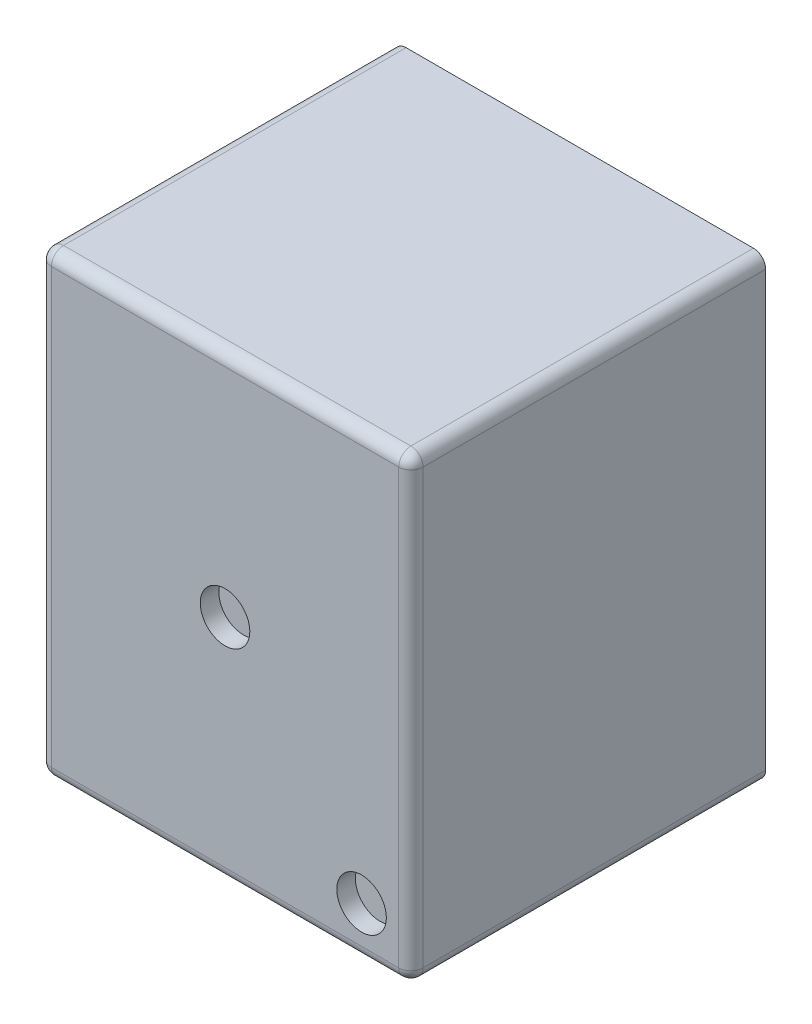
ISO-10303-21;
HEADER;
FILE_DESCRIPTION(('STEP AP214'),'2;1');
FILE_NAME('part.step','',(''),(''),'','','');
FILE_SCHEMA(('AUTOMOTIVE_DESIGN { 1 0 10303 214 1 1 1 1 }'));
ENDSEC;
DATA;
#1=APPLICATION_CONTEXT('core data for automotive mechanical design processes');
#2=APPLICATION_PROTOCOL_DEFINITION('international standard','automotive_design',2000,#1);
#3=PRODUCT_CONTEXT('',#1,'mechanical');
#4=PRODUCT('Part','Part','',(#3));
#5=PRODUCT_RELATED_PRODUCT_CATEGORY('part','',(#4));
#6=PRODUCT_DEFINITION_FORMATION('','',#4);
#7=PRODUCT_DEFINITION_CONTEXT('part definition',#1,'design');
#8=PRODUCT_DEFINITION('design','',#6,#7);
#9=PRODUCT_DEFINITION_SHAPE('','',#8);
#10=(LENGTH_UNIT() NAMED_UNIT(*) SI_UNIT(.MILLI.,.METRE.));
#11=(NAMED_UNIT(*) PLANE_ANGLE_UNIT() SI_UNIT($,.RADIAN.));
#12=(NAMED_UNIT(*) SI_UNIT($,.STERADIAN.) SOLID_ANGLE_UNIT());
#13=UNCERTAINTY_MEASURE_WITH_UNIT(LENGTH_MEASURE(1.E-05),#10,'distance_accuracy_value','');
#14=(GEOMETRIC_REPRESENTATION_CONTEXT(3) GLOBAL_UNCERTAINTY_ASSIGNED_CONTEXT((#13)) GLOBAL_UNIT_ASSIGNED_CONTEXT((#10,
#11,#12)) REPRESENTATION_CONTEXT('',''));
#15=CARTESIAN_POINT('',(0.,0.,0.));
#16=DIRECTION('',(0.,0.,1.));
#17=DIRECTION('',(1.,0.,0.));
#18=AXIS2_PLACEMENT_3D('',#15,#16,#17);
#19=CARTESIAN_POINT('',(0.352635714690617,0.168780356945077,0.617807641667743));
#20=DIRECTION('',(0.,0.,1.));
#21=DIRECTION('',(1.,0.,0.));
#22=AXIS2_PLACEMENT_3D('',#19,#20,#21);
#23=PLANE('',#22);
#24=CARTESIAN_POINT('',(0.352635714690617,0.168780356945077,0.617807641667743));
#25=DIRECTION('',(0.,0.,1.));
#26=DIRECTION('',(1.,0.,0.));
#27=AXIS2_PLACEMENT_3D('',#24,#25,#26);
#28=CIRCLE('',#27,0.04);
#29=CARTESIAN_POINT('',(0.392635714690617,0.168780356945077,0.617807641667743));
#30=VERTEX_POINT('',#29);
#31=EDGE_CURVE('E20',#30,#30,#28,.T.);
#32=ORIENTED_EDGE('',*,*,#31,.T.);
#33=EDGE_LOOP('',(#32));
#34=FACE_BOUND('',#33,.T.);
#35=ADVANCED_FACE('F17',(#34),#23,.T.);
#36=CARTESIAN_POINT('',(0.573079757545916,-0.121368087614107,0.617807641667743));
#37=DIRECTION('',(0.,0.,1.));
#38=DIRECTION('',(1.,0.,0.));
#39=AXIS2_PLACEMENT_3D('',#36,#37,#38);
#40=PLANE('',#39);
#41=CARTESIAN_POINT('',(0.573079757545916,-0.121368087614107,0.617807641667743));
#42=DIRECTION('',(0.,0.,1.));
#43=DIRECTION('',(1.,0.,0.));
#44=AXIS2_PLACEMENT_3D('',#41,#42,#43);
#45=CIRCLE('',#44,0.04);
#46=CARTESIAN_POINT('',(0.613079757545916,-0.121368087614107,0.617807641667743));
#47=VERTEX_POINT('',#46);
#48=EDGE_CURVE('E175',#47,#47,#45,.T.);
#49=ORIENTED_EDGE('',*,*,#48,.T.);
#50=EDGE_LOOP('',(#49));
#51=FACE_BOUND('',#50,.T.);
#52=ADVANCED_FACE('F187',(#51),#40,.T.);
#53=CARTESIAN_POINT('',(0.352635714690617,0.168780356945077,0.647807641667743));
#54=DIRECTION('',(0.,0.,1.));
#55=DIRECTION('',(1.,0.,0.));
#56=AXIS2_PLACEMENT_3D('',#53,#54,#55);
#57=CYLINDRICAL_SURFACE('',#56,0.04);
#58=ORIENTED_EDGE('',*,*,#31,.F.);
#59=EDGE_LOOP('',(#58));
#60=FACE_BOUND('',#59,.T.);
#61=CARTESIAN_POINT('',(0.352635714690617,0.168780356945077,0.647807641667743));
#62=DIRECTION('',(0.,0.,1.));
#63=DIRECTION('',(1.,0.,0.));
#64=AXIS2_PLACEMENT_3D('',#61,#62,#63);
#65=CIRCLE('',#64,0.04);
#66=CARTESIAN_POINT('',(0.392635714690617,0.168780356945077,0.647807641667743));
#67=VERTEX_POINT('',#66);
#68=EDGE_CURVE('E173',#67,#67,#65,.T.);
#69=ORIENTED_EDGE('',*,*,#68,.T.);
#70=EDGE_LOOP('',(#69));
#71=FACE_BOUND('',#70,.T.);
#72=ADVANCED_FACE('F183',(#60,#71),#57,.F.);
#73=CARTESIAN_POINT('',(0.573079757545916,-0.121368087614107,0.647807641667743));
#74=DIRECTION('',(0.,0.,1.));
#75=DIRECTION('',(1.,0.,0.));
#76=AXIS2_PLACEMENT_3D('',#73,#74,#75);
#77=CYLINDRICAL_SURFACE('',#76,0.04);
#78=ORIENTED_EDGE('',*,*,#48,.F.);
#79=EDGE_LOOP('',(#78));
#80=FACE_BOUND('',#79,.T.);
#81=CARTESIAN_POINT('',(0.573079757545916,-0.121368087614107,0.647807641667743));
#82=DIRECTION('',(0.,0.,1.));
#83=DIRECTION('',(1.,0.,0.));
#84=AXIS2_PLACEMENT_3D('',#81,#82,#83);
#85=CIRCLE('',#84,0.04);
#86=CARTESIAN_POINT('',(0.613079757545916,-0.121368087614107,0.647807641667743));
#87=VERTEX_POINT('',#86);
#88=EDGE_CURVE('E139',#87,#87,#85,.T.);
#89=ORIENTED_EDGE('',*,*,#88,.T.);
#90=EDGE_LOOP('',(#89));
#91=FACE_BOUND('',#90,.T.);
#92=ADVANCED_FACE('F186',(#80,#91),#77,.F.);
#93=CARTESIAN_POINT('',(0.0441472675497887,0.55394364596018,0.647807641667743));
#94=DIRECTION('',(0.,0.,-1.));
#95=DIRECTION('',(-1.,0.,0.));
#96=AXIS2_PLACEMENT_3D('',#93,#94,#95);
#97=PLANE('',#96);
#98=DIRECTION('',(0.,-1.,0.));
#99=VECTOR('',#98,1.);
#100=CARTESIAN_POINT('',(0.633079757545916,-0.216382932070025,0.647807641667743));
#101=LINE('',#100,#99);
#102=CARTESIAN_POINT('',(0.633079757545916,0.518928801504261,0.647807641667743));
#103=VERTEX_POINT('',#102);
#104=CARTESIAN_POINT('',(0.633079757545916,-0.181368087614107,0.647807641667743));
#105=VERTEX_POINT('',#104);
#106=EDGE_CURVE('E132',#103,#105,#101,.T.);
#107=ORIENTED_EDGE('',*,*,#106,.F.);
#108=DIRECTION('',(1.,0.,0.));
#109=VECTOR('',#108,1.);
#110=CARTESIAN_POINT('',(0.661124161831446,0.518928801504262,0.647807641667743));
#111=LINE('',#110,#109);
#112=CARTESIAN_POINT('',(0.0721916718353179,0.518928801504262,0.647807641667743));
#113=VERTEX_POINT('',#112);
#114=EDGE_CURVE('E126',#113,#103,#111,.T.);
#115=ORIENTED_EDGE('',*,*,#114,.F.);
#116=DIRECTION('',(0.,1.,0.));
#117=VECTOR('',#116,1.);
#118=CARTESIAN_POINT('',(0.0721916718353185,0.55394364596018,0.647807641667743));
#119=LINE('',#118,#117);
#120=CARTESIAN_POINT('',(0.0721916718353179,-0.181368087614107,0.647807641667743));
#121=VERTEX_POINT('',#120);
#122=EDGE_CURVE('E155',#121,#113,#119,.T.);
#123=ORIENTED_EDGE('',*,*,#122,.F.);
#124=DIRECTION('',(-1.,0.,0.));
#125=VECTOR('',#124,1.);
#126=CARTESIAN_POINT('',(0.0441472675497874,-0.181368087614107,0.647807641667743));
#127=LINE('',#126,#125);
#128=EDGE_CURVE('E131',#105,#121,#127,.T.);
#129=ORIENTED_EDGE('',*,*,#128,.F.);
#130=EDGE_LOOP('',(#107,#115,#123,#129));
#131=FACE_BOUND('',#130,.T.);
#132=ORIENTED_EDGE('',*,*,#88,.F.);
#133=EDGE_LOOP('',(#132));
#134=FACE_BOUND('',#133,.T.);
#135=ORIENTED_EDGE('',*,*,#68,.F.);
#136=EDGE_LOOP('',(#135));
#137=FACE_BOUND('',#136,.T.);
#138=ADVANCED_FACE('F135',(#131,#134,#137),#97,.F.);
#139=CARTESIAN_POINT('',(0.0441472675497874,-0.181368087614107,0.628135510520202));
#140=DIRECTION('',(-1.,0.,0.));
#141=DIRECTION('',(0.,-1.,0.));
#142=AXIS2_PLACEMENT_3D('',#139,#140,#141);
#143=CYLINDRICAL_SURFACE('',#142,0.019672131147541);
#144=DIRECTION('',(1.,0.,0.));
#145=VECTOR('',#144,1.);
#146=CARTESIAN_POINT('',(0.0525195406877774,-0.201040218761648,0.628135510520202));
#147=LINE('',#146,#145);
#148=CARTESIAN_POINT('',(0.633079757545916,-0.201040218761648,0.628135510520202));
#149=VERTEX_POINT('',#148);
#150=CARTESIAN_POINT('',(0.0721916718353173,-0.201040218761648,0.628135510520202));
#151=VERTEX_POINT('',#150);
#152=EDGE_CURVE('E293',#149,#151,#147,.F.);
#153=ORIENTED_EDGE('',*,*,#152,.F.);
#154=CARTESIAN_POINT('',(0.633079757545916,-0.181368087614107,0.628135510520202));
#155=DIRECTION('',(-1.,0.,0.));
#156=DIRECTION('',(0.,-1.,0.));
#157=AXIS2_PLACEMENT_3D('',#154,#155,#156);
#158=CIRCLE('',#157,0.019672131147541);
#159=EDGE_CURVE('E147',#105,#149,#158,.F.);
#160=ORIENTED_EDGE('',*,*,#159,.F.);
#161=ORIENTED_EDGE('',*,*,#128,.T.);
#162=CARTESIAN_POINT('',(0.0721916718353173,-0.181368087614107,0.628135510520202));
#163=DIRECTION('',(-1.,0.,0.));
#164=DIRECTION('',(0.,-1.,0.));
#165=AXIS2_PLACEMENT_3D('',#162,#163,#164);
#166=CIRCLE('',#165,0.019672131147541);
#167=EDGE_CURVE('E260',#151,#121,#166,.T.);
#168=ORIENTED_EDGE('',*,*,#167,.F.);
#169=EDGE_LOOP('',(#153,#160,#161,#168));
#170=FACE_BOUND('',#169,.T.);
#171=ADVANCED_FACE('F192',(#170),#143,.T.);
#172=CARTESIAN_POINT('',(0.633079757545916,-0.181368087614107,0.628135510520202));
#173=DIRECTION('',(0.,-1.,0.));
#174=DIRECTION('',(0.,0.,1.));
#175=AXIS2_PLACEMENT_3D('',#172,#173,#174);
#176=SPHERICAL_SURFACE('',#175,0.019672131147541);
#177=CARTESIAN_POINT('',(0.633079757545916,-0.181368087614107,0.628135510520202));
#178=DIRECTION('',(0.,-1.,0.));
#179=DIRECTION('',(1.,0.,0.));
#180=AXIS2_PLACEMENT_3D('',#177,#178,#179);
#181=CIRCLE('',#180,0.019672131147541);
#182=CARTESIAN_POINT('',(0.652751888693457,-0.181368087614107,0.628135510520202));
#183=VERTEX_POINT('',#182);
#184=EDGE_CURVE('E106',#105,#183,#181,.F.);
#185=ORIENTED_EDGE('',*,*,#184,.F.);
#186=ORIENTED_EDGE('',*,*,#159,.T.);
#187=CARTESIAN_POINT('',(0.633079757545916,-0.181368087614107,0.628135510520202));
#188=DIRECTION('',(0.,0.,-1.));
#189=DIRECTION('',(-1.,0.,0.));
#190=AXIS2_PLACEMENT_3D('',#187,#188,#189);
#191=CIRCLE('',#190,0.019672131147541);
#192=EDGE_CURVE('E283',#183,#149,#191,.T.);
#193=ORIENTED_EDGE('',*,*,#192,.F.);
#194=EDGE_LOOP('',(#185,#186,#193));
#195=FACE_BOUND('',#194,.T.);
#196=ADVANCED_FACE('F199',(#195),#176,.T.);
#197=CARTESIAN_POINT('',(0.633079757545916,-0.216382932070025,0.628135510520202));
#198=DIRECTION('',(0.,-1.,0.));
#199=DIRECTION('',(1.,0.,0.));
#200=AXIS2_PLACEMENT_3D('',#197,#198,#199);
#201=CYLINDRICAL_SURFACE('',#200,0.019672131147541);
#202=DIRECTION('',(0.,1.,0.));
#203=VECTOR('',#202,1.);
#204=CARTESIAN_POINT('',(0.652751888693456,-0.201040218761648,0.628135510520202));
#205=LINE('',#204,#203);
#206=CARTESIAN_POINT('',(0.652751888693457,0.518928801504261,0.628135510520202));
#207=VERTEX_POINT('',#206);
#208=EDGE_CURVE('E144',#207,#183,#205,.F.);
#209=ORIENTED_EDGE('',*,*,#208,.F.);
#210=CARTESIAN_POINT('',(0.633079757545916,0.518928801504261,0.628135510520202));
#211=DIRECTION('',(0.,-1.,0.));
#212=DIRECTION('',(0.,0.,1.));
#213=AXIS2_PLACEMENT_3D('',#210,#211,#212);
#214=CIRCLE('',#213,0.0196721311475411);
#215=EDGE_CURVE('E115',#103,#207,#214,.F.);
#216=ORIENTED_EDGE('',*,*,#215,.F.);
#217=ORIENTED_EDGE('',*,*,#106,.T.);
#218=ORIENTED_EDGE('',*,*,#184,.T.);
#219=EDGE_LOOP('',(#209,#216,#217,#218));
#220=FACE_BOUND('',#219,.T.);
#221=ADVANCED_FACE('F142',(#220),#201,.T.);
#222=CARTESIAN_POINT('',(0.633079757545916,0.518928801504261,0.628135510520202));
#223=DIRECTION('',(0.,-1.,0.));
#224=DIRECTION('',(0.,0.,1.));
#225=AXIS2_PLACEMENT_3D('',#222,#223,#224);
#226=SPHERICAL_SURFACE('',#225,0.019672131147541);
#227=CARTESIAN_POINT('',(0.633079757545916,0.518928801504261,0.628135510520202));
#228=DIRECTION('',(1.,0.,0.));
#229=DIRECTION('',(0.,1.,0.));
#230=AXIS2_PLACEMENT_3D('',#227,#228,#229);
#231=CIRCLE('',#230,0.019672131147541);
#232=CARTESIAN_POINT('',(0.633079757545916,0.538600932651802,0.628135510520202));
#233=VERTEX_POINT('',#232);
#234=EDGE_CURVE('E111',#103,#233,#231,.F.);
#235=ORIENTED_EDGE('',*,*,#234,.F.);
#236=ORIENTED_EDGE('',*,*,#215,.T.);
#237=CARTESIAN_POINT('',(0.633079757545916,0.518928801504261,0.628135510520202));
#238=DIRECTION('',(0.,0.,-1.));
#239=DIRECTION('',(-1.,0.,0.));
#240=AXIS2_PLACEMENT_3D('',#237,#238,#239);
#241=CIRCLE('',#240,0.019672131147541);
#242=EDGE_CURVE('E117',#233,#207,#241,.T.);
#243=ORIENTED_EDGE('',*,*,#242,.F.);
#244=EDGE_LOOP('',(#235,#236,#243));
#245=FACE_BOUND('',#244,.T.);
#246=ADVANCED_FACE('F113',(#245),#226,.T.);
#247=CARTESIAN_POINT('',(0.661124161831446,0.518928801504261,0.628135510520202));
#248=DIRECTION('',(1.,0.,0.));
#249=DIRECTION('',(0.,1.,0.));
#250=AXIS2_PLACEMENT_3D('',#247,#248,#249);
#251=CYLINDRICAL_SURFACE('',#250,0.019672131147541);
#252=DIRECTION('',(-1.,0.,0.));
#253=VECTOR('',#252,1.);
#254=CARTESIAN_POINT('',(0.652751888693456,0.538600932651802,0.628135510520202));
#255=LINE('',#254,#253);
#256=CARTESIAN_POINT('',(0.0721916718353177,0.538600932651803,0.628135510520202));
#257=VERTEX_POINT('',#256);
#258=EDGE_CURVE('E265',#257,#233,#255,.F.);
#259=ORIENTED_EDGE('',*,*,#258,.F.);
#260=CARTESIAN_POINT('',(0.0721916718353177,0.518928801504262,0.628135510520202));
#261=DIRECTION('',(-1.,0.,0.));
#262=DIRECTION('',(0.,-1.,0.));
#263=AXIS2_PLACEMENT_3D('',#260,#261,#262);
#264=CIRCLE('',#263,0.019672131147541);
#265=EDGE_CURVE('E122',#113,#257,#264,.T.);
#266=ORIENTED_EDGE('',*,*,#265,.F.);
#267=ORIENTED_EDGE('',*,*,#114,.T.);
#268=ORIENTED_EDGE('',*,*,#234,.T.);
#269=EDGE_LOOP('',(#259,#266,#267,#268));
#270=FACE_BOUND('',#269,.T.);
#271=ADVANCED_FACE('F128',(#270),#251,.T.);
#272=CARTESIAN_POINT('',(0.0721916718353177,0.518928801504262,0.628135510520202));
#273=DIRECTION('',(0.,-1.,0.));
#274=DIRECTION('',(0.,0.,1.));
#275=AXIS2_PLACEMENT_3D('',#272,#273,#274);
#276=SPHERICAL_SURFACE('',#275,0.019672131147541);
#277=CARTESIAN_POINT('',(0.0721916718353177,0.518928801504262,0.628135510520202));
#278=DIRECTION('',(0.,1.,0.));
#279=DIRECTION('',(-1.,0.,0.));
#280=AXIS2_PLACEMENT_3D('',#277,#278,#279);
#281=CIRCLE('',#280,0.019672131147541);
#282=CARTESIAN_POINT('',(0.052519540687777,0.518928801504262,0.628135510520202));
#283=VERTEX_POINT('',#282);
#284=EDGE_CURVE('E258',#113,#283,#281,.F.);
#285=ORIENTED_EDGE('',*,*,#284,.F.);
#286=ORIENTED_EDGE('',*,*,#265,.T.);
#287=CARTESIAN_POINT('',(0.0721916718353177,0.518928801504262,0.628135510520202));
#288=DIRECTION('',(0.,0.,-1.));
#289=DIRECTION('',(-1.,0.,0.));
#290=AXIS2_PLACEMENT_3D('',#287,#288,#289);
#291=CIRCLE('',#290,0.019672131147541);
#292=EDGE_CURVE('E251',#283,#257,#291,.T.);
#293=ORIENTED_EDGE('',*,*,#292,.F.);
#294=EDGE_LOOP('',(#285,#286,#293));
#295=FACE_BOUND('',#294,.T.);
#296=ADVANCED_FACE('F267',(#295),#276,.T.);
#297=CARTESIAN_POINT('',(0.0721916718353177,0.55394364596018,0.628135510520202));
#298=DIRECTION('',(0.,1.,0.));
#299=DIRECTION('',(-1.,0.,0.));
#300=AXIS2_PLACEMENT_3D('',#297,#298,#299);
#301=CYLINDRICAL_SURFACE('',#300,0.019672131147541);
#302=DIRECTION('',(0.,-1.,0.));
#303=VECTOR('',#302,1.);
#304=CARTESIAN_POINT('',(0.0525195406877774,0.538600932651803,0.628135510520202));
#305=LINE('',#304,#303);
#306=CARTESIAN_POINT('',(0.0525195406877765,-0.181368087614107,0.628135510520202));
#307=VERTEX_POINT('',#306);
#308=EDGE_CURVE('E254',#307,#283,#305,.F.);
#309=ORIENTED_EDGE('',*,*,#308,.F.);
#310=CARTESIAN_POINT('',(0.0721916718353173,-0.181368087614107,0.628135510520202));
#311=DIRECTION('',(0.,-1.,0.));
#312=DIRECTION('',(0.,0.,1.));
#313=AXIS2_PLACEMENT_3D('',#310,#311,#312);
#314=CIRCLE('',#313,0.0196721311475411);
#315=EDGE_CURVE('E75',#121,#307,#314,.T.);
#316=ORIENTED_EDGE('',*,*,#315,.F.);
#317=ORIENTED_EDGE('',*,*,#122,.T.);
#318=ORIENTED_EDGE('',*,*,#284,.T.);
#319=EDGE_LOOP('',(#309,#316,#317,#318));
#320=FACE_BOUND('',#319,.T.);
#321=ADVANCED_FACE('F244',(#320),#301,.T.);
#322=CARTESIAN_POINT('',(0.0721916718353173,-0.181368087614107,0.628135510520202));
#323=DIRECTION('',(0.,-1.,0.));
#324=DIRECTION('',(0.,0.,1.));
#325=AXIS2_PLACEMENT_3D('',#322,#323,#324);
#326=SPHERICAL_SURFACE('',#325,0.019672131147541);
#327=ORIENTED_EDGE('',*,*,#167,.T.);
#328=ORIENTED_EDGE('',*,*,#315,.T.);
#329=CARTESIAN_POINT('',(0.0721916718353173,-0.181368087614107,0.628135510520202));
#330=DIRECTION('',(0.,0.,-1.));
#331=DIRECTION('',(-1.,0.,0.));
#332=AXIS2_PLACEMENT_3D('',#329,#330,#331);
#333=CIRCLE('',#332,0.019672131147541);
#334=EDGE_CURVE('E515',#151,#307,#333,.T.);
#335=ORIENTED_EDGE('',*,*,#334,.F.);
#336=EDGE_LOOP('',(#327,#328,#335));
#337=FACE_BOUND('',#336,.T.);
#338=ADVANCED_FACE('F240',(#337),#326,.T.);
#339=CARTESIAN_POINT('',(0.0525195406877774,-0.201040218761648,0.0553202271847168));
#340=DIRECTION('',(0.,-1.,0.));
#341=DIRECTION('',(1.,0.,0.));
#342=AXIS2_PLACEMENT_3D('',#339,#340,#341);
#343=PLANE('',#342);
#344=DIRECTION('',(0.,0.,1.));
#345=VECTOR('',#344,1.);
#346=CARTESIAN_POINT('',(0.0721916718353173,-0.201040218761648,0.0553202271847168));
#347=LINE('',#346,#345);
#348=CARTESIAN_POINT('',(0.0721916718353173,-0.201040218761648,0.0749923583322578));
#349=VERTEX_POINT('',#348);
#350=EDGE_CURVE('E67',#151,#349,#347,.F.);
#351=ORIENTED_EDGE('',*,*,#350,.T.);
#352=DIRECTION('',(1.,0.,0.));
#353=VECTOR('',#352,1.);
#354=CARTESIAN_POINT('',(0.352635714690617,-0.201040218761648,0.0749923583322578));
#355=LINE('',#354,#353);
#356=CARTESIAN_POINT('',(0.633079757545916,-0.201040218761648,0.0749923583322578));
#357=VERTEX_POINT('',#356);
#358=EDGE_CURVE('E168',#349,#357,#355,.T.);
#359=ORIENTED_EDGE('',*,*,#358,.T.);
#360=DIRECTION('',(0.,0.,-1.));
#361=VECTOR('',#360,1.);
#362=CARTESIAN_POINT('',(0.633079757545916,-0.201040218761648,0.0553202271847168));
#363=LINE('',#362,#361);
#364=EDGE_CURVE('E59',#149,#357,#363,.T.);
#365=ORIENTED_EDGE('',*,*,#364,.F.);
#366=ORIENTED_EDGE('',*,*,#152,.T.);
#367=EDGE_LOOP('',(#351,#359,#365,#366));
#368=FACE_BOUND('',#367,.T.);
#369=ADVANCED_FACE('F237',(#368),#343,.T.);
#370=CARTESIAN_POINT('',(0.633079757545916,-0.181368087614107,0.0553202271847168));
#371=DIRECTION('',(0.,0.,-1.));
#372=DIRECTION('',(-1.,0.,0.));
#373=AXIS2_PLACEMENT_3D('',#370,#371,#372);
#374=CYLINDRICAL_SURFACE('',#373,0.019672131147541);
#375=DIRECTION('',(0.,0.,1.));
#376=VECTOR('',#375,1.);
#377=CARTESIAN_POINT('',(0.652751888693456,-0.181368087614107,0.0553202271847168));
#378=LINE('',#377,#376);
#379=CARTESIAN_POINT('',(0.652751888693456,-0.181368087614107,0.0749923583322578));
#380=VERTEX_POINT('',#379);
#381=EDGE_CURVE('E282',#183,#380,#378,.F.);
#382=ORIENTED_EDGE('',*,*,#381,.F.);
#383=ORIENTED_EDGE('',*,*,#192,.T.);
#384=ORIENTED_EDGE('',*,*,#364,.T.);
#385=CARTESIAN_POINT('',(0.633079757545916,-0.181368087614107,0.0749923583322578));
#386=DIRECTION('',(0.,0.,-1.));
#387=DIRECTION('',(-1.,0.,0.));
#388=AXIS2_PLACEMENT_3D('',#385,#386,#387);
#389=CIRCLE('',#388,0.019672131147541);
#390=EDGE_CURVE('E166',#357,#380,#389,.F.);
#391=ORIENTED_EDGE('',*,*,#390,.T.);
#392=EDGE_LOOP('',(#382,#383,#384,#391));
#393=FACE_BOUND('',#392,.T.);
#394=ADVANCED_FACE('F233',(#393),#374,.T.);
#395=CARTESIAN_POINT('',(0.652751888693456,-0.201040218761648,0.0553202271847168));
#396=DIRECTION('',(1.,0.,0.));
#397=DIRECTION('',(0.,1.,0.));
#398=AXIS2_PLACEMENT_3D('',#395,#396,#397);
#399=PLANE('',#398);
#400=ORIENTED_EDGE('',*,*,#208,.T.);
#401=ORIENTED_EDGE('',*,*,#381,.T.);
#402=DIRECTION('',(0.,1.,0.));
#403=VECTOR('',#402,1.);
#404=CARTESIAN_POINT('',(0.652751888693456,0.168780356945077,0.0749923583322578));
#405=LINE('',#404,#403);
#406=CARTESIAN_POINT('',(0.652751888693457,0.518928801504261,0.0749923583322578));
#407=VERTEX_POINT('',#406);
#408=EDGE_CURVE('E165',#380,#407,#405,.T.);
#409=ORIENTED_EDGE('',*,*,#408,.T.);
#410=DIRECTION('',(0.,0.,-1.));
#411=VECTOR('',#410,1.);
#412=CARTESIAN_POINT('',(0.652751888693457,0.518928801504261,0.0553202271847168));
#413=LINE('',#412,#411);
#414=EDGE_CURVE('E533',#207,#407,#413,.T.);
#415=ORIENTED_EDGE('',*,*,#414,.F.);
#416=EDGE_LOOP('',(#400,#401,#409,#415));
#417=FACE_BOUND('',#416,.T.);
#418=ADVANCED_FACE('F229',(#417),#399,.T.);
#419=CARTESIAN_POINT('',(0.633079757545916,0.518928801504261,0.0553202271847168));
#420=DIRECTION('',(0.,0.,-1.));
#421=DIRECTION('',(-1.,0.,0.));
#422=AXIS2_PLACEMENT_3D('',#419,#420,#421);
#423=CYLINDRICAL_SURFACE('',#422,0.019672131147541);
#424=DIRECTION('',(0.,0.,1.));
#425=VECTOR('',#424,1.);
#426=CARTESIAN_POINT('',(0.633079757545916,0.538600932651802,0.0553202271847168));
#427=LINE('',#426,#425);
#428=CARTESIAN_POINT('',(0.633079757545916,0.538600932651802,0.0749923583322578));
#429=VERTEX_POINT('',#428);
#430=EDGE_CURVE('E526',#233,#429,#427,.F.);
#431=ORIENTED_EDGE('',*,*,#430,.F.);
#432=ORIENTED_EDGE('',*,*,#242,.T.);
#433=ORIENTED_EDGE('',*,*,#414,.T.);
#434=CARTESIAN_POINT('',(0.633079757545916,0.518928801504261,0.0749923583322578));
#435=DIRECTION('',(0.,0.,-1.));
#436=DIRECTION('',(-1.,0.,0.));
#437=AXIS2_PLACEMENT_3D('',#434,#435,#436);
#438=CIRCLE('',#437,0.019672131147541);
#439=EDGE_CURVE('E163',#407,#429,#438,.F.);
#440=ORIENTED_EDGE('',*,*,#439,.T.);
#441=EDGE_LOOP('',(#431,#432,#433,#440));
#442=FACE_BOUND('',#441,.T.);
#443=ADVANCED_FACE('F225',(#442),#423,.T.);
#444=CARTESIAN_POINT('',(0.652751888693456,0.538600932651802,0.0553202271847168));
#445=DIRECTION('',(0.,1.,0.));
#446=DIRECTION('',(-1.,0.,0.));
#447=AXIS2_PLACEMENT_3D('',#444,#445,#446);
#448=PLANE('',#447);
#449=ORIENTED_EDGE('',*,*,#258,.T.);
#450=ORIENTED_EDGE('',*,*,#430,.T.);
#451=DIRECTION('',(1.,0.,0.));
#452=VECTOR('',#451,1.);
#453=CARTESIAN_POINT('',(0.352635714690617,0.538600932651802,0.0749923583322578));
#454=LINE('',#453,#452);
#455=CARTESIAN_POINT('',(0.0721916718353177,0.538600932651803,0.0749923583322578));
#456=VERTEX_POINT('',#455);
#457=EDGE_CURVE('E162',#429,#456,#454,.F.);
#458=ORIENTED_EDGE('',*,*,#457,.T.);
#459=DIRECTION('',(0.,0.,-1.));
#460=VECTOR('',#459,1.);
#461=CARTESIAN_POINT('',(0.0721916718353177,0.538600932651803,0.0553202271847168));
#462=LINE('',#461,#460);
#463=EDGE_CURVE('E255',#257,#456,#462,.T.);
#464=ORIENTED_EDGE('',*,*,#463,.F.);
#465=EDGE_LOOP('',(#449,#450,#458,#464));
#466=FACE_BOUND('',#465,.T.);
#467=ADVANCED_FACE('F221',(#466),#448,.T.);
#468=CARTESIAN_POINT('',(0.0721916718353177,0.518928801504262,0.0553202271847168));
#469=DIRECTION('',(0.,0.,-1.));
#470=DIRECTION('',(-1.,0.,0.));
#471=AXIS2_PLACEMENT_3D('',#468,#469,#470);
#472=CYLINDRICAL_SURFACE('',#471,0.019672131147541);
#473=DIRECTION('',(0.,0.,1.));
#474=VECTOR('',#473,1.);
#475=CARTESIAN_POINT('',(0.0525195406877774,0.518928801504262,0.0553202271847168));
#476=LINE('',#475,#474);
#477=CARTESIAN_POINT('',(0.0525195406877774,0.518928801504262,0.0749923583322578));
#478=VERTEX_POINT('',#477);
#479=EDGE_CURVE('E513',#283,#478,#476,.F.);
#480=ORIENTED_EDGE('',*,*,#479,.F.);
#481=ORIENTED_EDGE('',*,*,#292,.T.);
#482=ORIENTED_EDGE('',*,*,#463,.T.);
#483=CARTESIAN_POINT('',(0.0721916718353177,0.518928801504262,0.0749923583322578));
#484=DIRECTION('',(0.,0.,-1.));
#485=DIRECTION('',(-1.,0.,0.));
#486=AXIS2_PLACEMENT_3D('',#483,#484,#485);
#487=CIRCLE('',#486,0.019672131147541);
#488=EDGE_CURVE('E26',#456,#478,#487,.F.);
#489=ORIENTED_EDGE('',*,*,#488,.T.);
#490=EDGE_LOOP('',(#480,#481,#482,#489));
#491=FACE_BOUND('',#490,.T.);
#492=ADVANCED_FACE('F217',(#491),#472,.T.);
#493=CARTESIAN_POINT('',(0.0525195406877774,0.538600932651803,0.0553202271847168));
#494=DIRECTION('',(-1.,0.,0.));
#495=DIRECTION('',(0.,-1.,0.));
#496=AXIS2_PLACEMENT_3D('',#493,#494,#495);
#497=PLANE('',#496);
#498=ORIENTED_EDGE('',*,*,#308,.T.);
#499=ORIENTED_EDGE('',*,*,#479,.T.);
#500=DIRECTION('',(0.,1.,0.));
#501=VECTOR('',#500,1.);
#502=CARTESIAN_POINT('',(0.0525195406877774,0.168780356945077,0.0749923583322578));
#503=LINE('',#502,#501);
#504=CARTESIAN_POINT('',(0.0525195406877768,-0.181368087614107,0.0749923583322578));
#505=VERTEX_POINT('',#504);
#506=EDGE_CURVE('E11',#478,#505,#503,.F.);
#507=ORIENTED_EDGE('',*,*,#506,.T.);
#508=DIRECTION('',(0.,0.,-1.));
#509=VECTOR('',#508,1.);
#510=CARTESIAN_POINT('',(0.0525195406877763,-0.181368087614107,0.0553202271847168));
#511=LINE('',#510,#509);
#512=EDGE_CURVE('E170',#307,#505,#511,.T.);
#513=ORIENTED_EDGE('',*,*,#512,.F.);
#514=EDGE_LOOP('',(#498,#499,#507,#513));
#515=FACE_BOUND('',#514,.T.);
#516=ADVANCED_FACE('F211',(#515),#497,.T.);
#517=CARTESIAN_POINT('',(0.0721916718353173,-0.181368087614107,0.0553202271847168));
#518=DIRECTION('',(0.,0.,-1.));
#519=DIRECTION('',(-1.,0.,0.));
#520=AXIS2_PLACEMENT_3D('',#517,#518,#519);
#521=CYLINDRICAL_SURFACE('',#520,0.019672131147541);
#522=ORIENTED_EDGE('',*,*,#512,.T.);
#523=CARTESIAN_POINT('',(0.0721916718353173,-0.181368087614107,0.0749923583322578));
#524=DIRECTION('',(0.,0.,-1.));
#525=DIRECTION('',(-1.,0.,0.));
#526=AXIS2_PLACEMENT_3D('',#523,#524,#525);
#527=CIRCLE('',#526,0.019672131147541);
#528=EDGE_CURVE('E35',#505,#349,#527,.F.);
#529=ORIENTED_EDGE('',*,*,#528,.T.);
#530=ORIENTED_EDGE('',*,*,#350,.F.);
#531=ORIENTED_EDGE('',*,*,#334,.T.);
#532=EDGE_LOOP('',(#522,#529,#530,#531));
#533=FACE_BOUND('',#532,.T.);
#534=ADVANCED_FACE('F206',(#533),#521,.T.);
#535=CARTESIAN_POINT('',(0.352635714690617,0.168780356945077,0.0749923583322578));
#536=DIRECTION('',(0.,0.,1.));
#537=DIRECTION('',(1.,0.,0.));
#538=AXIS2_PLACEMENT_3D('',#535,#536,#537);
#539=PLANE('',#538);
#540=ORIENTED_EDGE('',*,*,#506,.F.);
#541=ORIENTED_EDGE('',*,*,#488,.F.);
#542=ORIENTED_EDGE('',*,*,#457,.F.);
#543=ORIENTED_EDGE('',*,*,#439,.F.);
#544=ORIENTED_EDGE('',*,*,#408,.F.);
#545=ORIENTED_EDGE('',*,*,#390,.F.);
#546=ORIENTED_EDGE('',*,*,#358,.F.);
#547=ORIENTED_EDGE('',*,*,#528,.F.);
#548=EDGE_LOOP('',(#540,#541,#542,#543,#544,#545,#546,#547));
#549=FACE_BOUND('',#548,.T.);
#550=ADVANCED_FACE('F204',(#549),#539,.F.);
#551=CLOSED_SHELL('',(#35,#52,#72,#92,#138,#171,#196,#221,#246,#271,#296,#321,#338,#369,#394,
#418,#443,#467,#492,#516,#534,#550));
#552=MANIFOLD_SOLID_BREP('B1',#551);
#553=ADVANCED_BREP_SHAPE_REPRESENTATION('',(#18,#552),#14);
#554=SHAPE_DEFINITION_REPRESENTATION(#9,#553);
ENDSEC;
END-ISO-10303-21;
